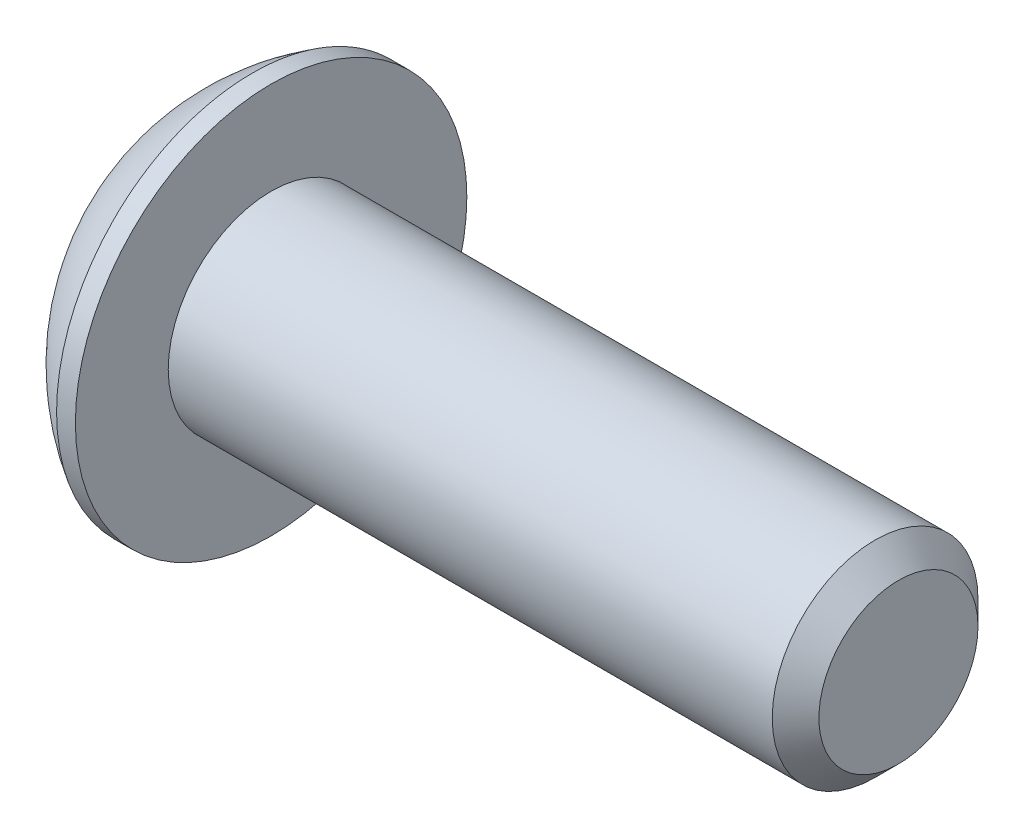
ISO-10303-21;
HEADER;
FILE_DESCRIPTION(('STEP AP214'),'2;1');
FILE_NAME('part.step','',(''),(''),'','','');
FILE_SCHEMA(('AUTOMOTIVE_DESIGN { 1 0 10303 214 1 1 1 1 }'));
ENDSEC;
DATA;
#1=APPLICATION_CONTEXT('core data for automotive mechanical design processes');
#2=APPLICATION_PROTOCOL_DEFINITION('international standard','automotive_design',2000,#1);
#3=PRODUCT_CONTEXT('',#1,'mechanical');
#4=PRODUCT('Part','Part','',(#3));
#5=PRODUCT_RELATED_PRODUCT_CATEGORY('part','',(#4));
#6=PRODUCT_DEFINITION_FORMATION('','',#4);
#7=PRODUCT_DEFINITION_CONTEXT('part definition',#1,'design');
#8=PRODUCT_DEFINITION('design','',#6,#7);
#9=PRODUCT_DEFINITION_SHAPE('','',#8);
#10=(LENGTH_UNIT() NAMED_UNIT(*) SI_UNIT(.MILLI.,.METRE.));
#11=(NAMED_UNIT(*) PLANE_ANGLE_UNIT() SI_UNIT($,.RADIAN.));
#12=(NAMED_UNIT(*) SI_UNIT($,.STERADIAN.) SOLID_ANGLE_UNIT());
#13=UNCERTAINTY_MEASURE_WITH_UNIT(LENGTH_MEASURE(1.E-05),#10,'distance_accuracy_value','');
#14=(GEOMETRIC_REPRESENTATION_CONTEXT(3) GLOBAL_UNCERTAINTY_ASSIGNED_CONTEXT((#13)) GLOBAL_UNIT_ASSIGNED_CONTEXT((#10,
#11,#12)) REPRESENTATION_CONTEXT('',''));
#15=CARTESIAN_POINT('',(0.,0.,0.));
#16=DIRECTION('',(0.,0.,1.));
#17=DIRECTION('',(1.,0.,0.));
#18=AXIS2_PLACEMENT_3D('',#15,#16,#17);
#19=CARTESIAN_POINT('',(1.32080000000034,0.,0.));
#20=DIRECTION('',(-1.,0.,0.));
#21=DIRECTION('',(0.,0.,-1.));
#22=AXIS2_PLACEMENT_3D('',#19,#20,#21);
#23=CONICAL_SURFACE('',#22,1.1937999999998,1.04719755119608);
#24=CARTESIAN_POINT('',(2.01004075135902,0.,-4.44089209850063E-13));
#25=VERTEX_POINT('',#24);
#26=VERTEX_LOOP('',#25);
#27=FACE_BOUND('',#26,.T.);
#28=CARTESIAN_POINT('',(1.32080000000009,0.,0.));
#29=DIRECTION('',(1.,0.,0.));
#30=DIRECTION('',(0.,0.,-1.));
#31=AXIS2_PLACEMENT_3D('',#28,#29,#30);
#32=CIRCLE('',#31,1.19380000000024);
#33=CARTESIAN_POINT('',(1.32080000000004,-1.03386112703797,-0.59690000000006));
#34=VERTEX_POINT('',#33);
#35=CARTESIAN_POINT('',(1.32080000000004,0.,-1.19380000000012));
#36=VERTEX_POINT('',#35);
#37=EDGE_CURVE('E37',#34,#36,#32,.T.);
#38=ORIENTED_EDGE('',*,*,#37,.F.);
#39=CARTESIAN_POINT('',(1.32080000000009,0.,0.));
#40=DIRECTION('',(1.,0.,0.));
#41=DIRECTION('',(0.,0.,-1.));
#42=AXIS2_PLACEMENT_3D('',#39,#40,#41);
#43=CIRCLE('',#42,1.19380000000024);
#44=CARTESIAN_POINT('',(1.32080000000004,-1.03386112703797,0.59690000000006));
#45=VERTEX_POINT('',#44);
#46=EDGE_CURVE('E127',#45,#34,#43,.T.);
#47=ORIENTED_EDGE('',*,*,#46,.F.);
#48=CARTESIAN_POINT('',(1.32080000000009,0.,0.));
#49=DIRECTION('',(1.,0.,0.));
#50=DIRECTION('',(0.,0.,-1.));
#51=AXIS2_PLACEMENT_3D('',#48,#49,#50);
#52=CIRCLE('',#51,1.19380000000024);
#53=CARTESIAN_POINT('',(1.32080000000004,1.49457637585666E-12,1.19380000000012));
#54=VERTEX_POINT('',#53);
#55=EDGE_CURVE('E133',#54,#45,#52,.T.);
#56=ORIENTED_EDGE('',*,*,#55,.F.);
#57=CARTESIAN_POINT('',(1.32080000000009,0.,0.));
#58=DIRECTION('',(1.,0.,0.));
#59=DIRECTION('',(0.,0.,-1.));
#60=AXIS2_PLACEMENT_3D('',#57,#58,#59);
#61=CIRCLE('',#60,1.19380000000024);
#62=CARTESIAN_POINT('',(1.32080000000004,1.03386112703797,0.596900000000061));
#63=VERTEX_POINT('',#62);
#64=EDGE_CURVE('E147',#63,#54,#61,.T.);
#65=ORIENTED_EDGE('',*,*,#64,.F.);
#66=CARTESIAN_POINT('',(1.32080000000009,0.,0.));
#67=DIRECTION('',(1.,0.,0.));
#68=DIRECTION('',(0.,0.,-1.));
#69=AXIS2_PLACEMENT_3D('',#66,#67,#68);
#70=CIRCLE('',#69,1.19380000000024);
#71=CARTESIAN_POINT('',(1.32080000000004,1.03386112703797,-0.596900000000061));
#72=VERTEX_POINT('',#71);
#73=EDGE_CURVE('E140',#72,#63,#70,.T.);
#74=ORIENTED_EDGE('',*,*,#73,.F.);
#75=CARTESIAN_POINT('',(1.32080000000009,0.,0.));
#76=DIRECTION('',(1.,0.,0.));
#77=DIRECTION('',(0.,0.,-1.));
#78=AXIS2_PLACEMENT_3D('',#75,#76,#77);
#79=CIRCLE('',#78,1.19380000000024);
#80=EDGE_CURVE('E137',#36,#72,#79,.T.);
#81=ORIENTED_EDGE('',*,*,#80,.F.);
#82=EDGE_LOOP('',(#38,#47,#56,#65,#74,#81));
#83=FACE_BOUND('',#82,.T.);
#84=ADVANCED_FACE('F34',(#27,#83),#23,.F.);
#85=CARTESIAN_POINT('',(1.3208,-2.06772225407572,1.1938));
#86=DIRECTION('',(1.,0.,0.));
#87=DIRECTION('',(0.,0.,1.));
#88=AXIS2_PLACEMENT_3D('',#85,#86,#87);
#89=PLANE('',#88);
#90=DIRECTION('',(0.,0.5,-0.866025403784439));
#91=VECTOR('',#90,1.);
#92=CARTESIAN_POINT('',(1.3208,-1.37848150271715,0.));
#93=LINE('',#92,#91);
#94=CARTESIAN_POINT('',(1.3208,-0.689240751358574,-1.1938));
#95=VERTEX_POINT('',#94);
#96=EDGE_CURVE('E109',#95,#34,#93,.F.);
#97=ORIENTED_EDGE('',*,*,#96,.T.);
#98=ORIENTED_EDGE('',*,*,#37,.T.);
#99=DIRECTION('',(0.,1.,0.));
#100=VECTOR('',#99,1.);
#101=CARTESIAN_POINT('',(1.3208,-0.689240751358574,-1.1938));
#102=LINE('',#101,#100);
#103=EDGE_CURVE('E124',#36,#95,#102,.F.);
#104=ORIENTED_EDGE('',*,*,#103,.T.);
#105=EDGE_LOOP('',(#97,#98,#104));
#106=FACE_BOUND('',#105,.T.);
#107=ADVANCED_FACE('F121',(#106),#89,.F.);
#108=CARTESIAN_POINT('',(1.3208,-2.06772225407572,1.1938));
#109=DIRECTION('',(1.,0.,0.));
#110=DIRECTION('',(0.,0.,1.));
#111=AXIS2_PLACEMENT_3D('',#108,#109,#110);
#112=PLANE('',#111);
#113=DIRECTION('',(0.,-0.5,-0.866025403784439));
#114=VECTOR('',#113,1.);
#115=CARTESIAN_POINT('',(1.3208,-0.689240751358574,1.1938));
#116=LINE('',#115,#114);
#117=CARTESIAN_POINT('',(1.3208,-1.37848150271715,0.));
#118=VERTEX_POINT('',#117);
#119=EDGE_CURVE('E129',#118,#45,#116,.F.);
#120=ORIENTED_EDGE('',*,*,#119,.T.);
#121=ORIENTED_EDGE('',*,*,#46,.T.);
#122=DIRECTION('',(0.,0.5,-0.866025403784439));
#123=VECTOR('',#122,1.);
#124=CARTESIAN_POINT('',(1.3208,-1.37848150271715,0.));
#125=LINE('',#124,#123);
#126=EDGE_CURVE('E104',#34,#118,#125,.F.);
#127=ORIENTED_EDGE('',*,*,#126,.T.);
#128=EDGE_LOOP('',(#120,#121,#127));
#129=FACE_BOUND('',#128,.T.);
#130=ADVANCED_FACE('F128',(#129),#112,.F.);
#131=CARTESIAN_POINT('',(1.3208,-2.06772225407572,1.1938));
#132=DIRECTION('',(1.,0.,0.));
#133=DIRECTION('',(0.,0.,1.));
#134=AXIS2_PLACEMENT_3D('',#131,#132,#133);
#135=PLANE('',#134);
#136=DIRECTION('',(0.,1.,0.));
#137=VECTOR('',#136,1.);
#138=CARTESIAN_POINT('',(1.3208,0.689240751358577,1.1938));
#139=LINE('',#138,#137);
#140=CARTESIAN_POINT('',(1.3208,-0.689240751358574,1.1938));
#141=VERTEX_POINT('',#140);
#142=EDGE_CURVE('E166',#141,#54,#139,.T.);
#143=ORIENTED_EDGE('',*,*,#142,.T.);
#144=ORIENTED_EDGE('',*,*,#55,.T.);
#145=DIRECTION('',(0.,-0.5,-0.866025403784439));
#146=VECTOR('',#145,1.);
#147=CARTESIAN_POINT('',(1.3208,-0.689240751358574,1.1938));
#148=LINE('',#147,#146);
#149=EDGE_CURVE('E164',#45,#141,#148,.F.);
#150=ORIENTED_EDGE('',*,*,#149,.T.);
#151=EDGE_LOOP('',(#143,#144,#150));
#152=FACE_BOUND('',#151,.T.);
#153=ADVANCED_FACE('F163',(#152),#135,.F.);
#154=CARTESIAN_POINT('',(1.3208,-2.06772225407572,1.1938));
#155=DIRECTION('',(1.,0.,0.));
#156=DIRECTION('',(0.,0.,1.));
#157=AXIS2_PLACEMENT_3D('',#154,#155,#156);
#158=PLANE('',#157);
#159=DIRECTION('',(0.,-0.5,0.866025403784439));
#160=VECTOR('',#159,1.);
#161=CARTESIAN_POINT('',(1.3208,1.37848150271715,0.));
#162=LINE('',#161,#160);
#163=CARTESIAN_POINT('',(1.3208,0.689240751358577,1.1938));
#164=VERTEX_POINT('',#163);
#165=EDGE_CURVE('E173',#164,#63,#162,.F.);
#166=ORIENTED_EDGE('',*,*,#165,.T.);
#167=ORIENTED_EDGE('',*,*,#64,.T.);
#168=DIRECTION('',(0.,1.,0.));
#169=VECTOR('',#168,1.);
#170=CARTESIAN_POINT('',(1.3208,0.689240751358577,1.1938));
#171=LINE('',#170,#169);
#172=EDGE_CURVE('E171',#54,#164,#171,.T.);
#173=ORIENTED_EDGE('',*,*,#172,.T.);
#174=EDGE_LOOP('',(#166,#167,#173));
#175=FACE_BOUND('',#174,.T.);
#176=ADVANCED_FACE('F170',(#175),#158,.F.);
#177=CARTESIAN_POINT('',(1.3208,-2.06772225407572,1.1938));
#178=DIRECTION('',(1.,0.,0.));
#179=DIRECTION('',(0.,0.,1.));
#180=AXIS2_PLACEMENT_3D('',#177,#178,#179);
#181=PLANE('',#180);
#182=DIRECTION('',(0.,0.5,0.866025403784439));
#183=VECTOR('',#182,1.);
#184=CARTESIAN_POINT('',(1.3208,0.689240751358576,-1.1938));
#185=LINE('',#184,#183);
#186=CARTESIAN_POINT('',(1.3208,1.37848150271715,0.));
#187=VERTEX_POINT('',#186);
#188=EDGE_CURVE('E184',#187,#72,#185,.F.);
#189=ORIENTED_EDGE('',*,*,#188,.T.);
#190=ORIENTED_EDGE('',*,*,#73,.T.);
#191=DIRECTION('',(0.,-0.5,0.866025403784439));
#192=VECTOR('',#191,1.);
#193=CARTESIAN_POINT('',(1.3208,1.37848150271715,0.));
#194=LINE('',#193,#192);
#195=EDGE_CURVE('E176',#63,#187,#194,.F.);
#196=ORIENTED_EDGE('',*,*,#195,.T.);
#197=EDGE_LOOP('',(#189,#190,#196));
#198=FACE_BOUND('',#197,.T.);
#199=ADVANCED_FACE('F182',(#198),#181,.F.);
#200=CARTESIAN_POINT('',(1.3208,-2.06772225407572,1.1938));
#201=DIRECTION('',(1.,0.,0.));
#202=DIRECTION('',(0.,0.,1.));
#203=AXIS2_PLACEMENT_3D('',#200,#201,#202);
#204=PLANE('',#203);
#205=DIRECTION('',(0.,1.,0.));
#206=VECTOR('',#205,1.);
#207=CARTESIAN_POINT('',(1.3208,-0.689240751358574,-1.1938));
#208=LINE('',#207,#206);
#209=CARTESIAN_POINT('',(1.3208,0.689240751358576,-1.1938));
#210=VERTEX_POINT('',#209);
#211=EDGE_CURVE('E144',#210,#36,#208,.F.);
#212=ORIENTED_EDGE('',*,*,#211,.T.);
#213=ORIENTED_EDGE('',*,*,#80,.T.);
#214=DIRECTION('',(0.,0.5,0.866025403784439));
#215=VECTOR('',#214,1.);
#216=CARTESIAN_POINT('',(1.3208,0.689240751358576,-1.1938));
#217=LINE('',#216,#215);
#218=EDGE_CURVE('E186',#72,#210,#217,.F.);
#219=ORIENTED_EDGE('',*,*,#218,.T.);
#220=EDGE_LOOP('',(#212,#213,#219));
#221=FACE_BOUND('',#220,.T.);
#222=ADVANCED_FACE('F307',(#221),#204,.F.);
#223=CARTESIAN_POINT('',(1.3208,-0.689240751358574,-1.1938));
#224=DIRECTION('',(0.,0.,1.));
#225=DIRECTION('',(0.,1.,0.));
#226=AXIS2_PLACEMENT_3D('',#223,#224,#225);
#227=PLANE('',#226);
#228=DIRECTION('',(0.,1.,0.));
#229=VECTOR('',#228,1.);
#230=CARTESIAN_POINT('',(0.,0.,-1.1938));
#231=LINE('',#230,#229);
#232=CARTESIAN_POINT('',(0.,0.689240751358577,-1.1938));
#233=VERTEX_POINT('',#232);
#234=CARTESIAN_POINT('',(0.,-0.689240751358574,-1.1938));
#235=VERTEX_POINT('',#234);
#236=EDGE_CURVE('E194',#233,#235,#231,.F.);
#237=ORIENTED_EDGE('',*,*,#236,.T.);
#238=DIRECTION('',(1.,0.,0.));
#239=VECTOR('',#238,1.);
#240=CARTESIAN_POINT('',(1.3208,-0.689240751358574,-1.1938));
#241=LINE('',#240,#239);
#242=EDGE_CURVE('E116',#235,#95,#241,.T.);
#243=ORIENTED_EDGE('',*,*,#242,.T.);
#244=ORIENTED_EDGE('',*,*,#103,.F.);
#245=ORIENTED_EDGE('',*,*,#211,.F.);
#246=DIRECTION('',(1.,0.,0.));
#247=VECTOR('',#246,1.);
#248=CARTESIAN_POINT('',(1.3208,0.689240751358576,-1.1938));
#249=LINE('',#248,#247);
#250=EDGE_CURVE('E189',#210,#233,#249,.F.);
#251=ORIENTED_EDGE('',*,*,#250,.T.);
#252=EDGE_LOOP('',(#237,#243,#244,#245,#251));
#253=FACE_BOUND('',#252,.T.);
#254=ADVANCED_FACE('F273',(#253),#227,.T.);
#255=CARTESIAN_POINT('',(1.3208,-1.37848150271715,0.));
#256=DIRECTION('',(0.,0.866025403784439,0.5));
#257=DIRECTION('',(0.,0.5,-0.866025403784439));
#258=AXIS2_PLACEMENT_3D('',#255,#256,#257);
#259=PLANE('',#258);
#260=DIRECTION('',(0.,-0.5,0.866025403784439));
#261=VECTOR('',#260,1.);
#262=CARTESIAN_POINT('',(0.,-0.689240751358574,-1.1938));
#263=LINE('',#262,#261);
#264=CARTESIAN_POINT('',(0.,-1.37848150271715,0.));
#265=VERTEX_POINT('',#264);
#266=EDGE_CURVE('E270',#235,#265,#263,.T.);
#267=ORIENTED_EDGE('',*,*,#266,.T.);
#268=DIRECTION('',(1.,0.,0.));
#269=VECTOR('',#268,1.);
#270=CARTESIAN_POINT('',(1.3208,-1.37848150271715,0.));
#271=LINE('',#270,#269);
#272=EDGE_CURVE('E111',#265,#118,#271,.T.);
#273=ORIENTED_EDGE('',*,*,#272,.T.);
#274=ORIENTED_EDGE('',*,*,#126,.F.);
#275=ORIENTED_EDGE('',*,*,#96,.F.);
#276=ORIENTED_EDGE('',*,*,#242,.F.);
#277=EDGE_LOOP('',(#267,#273,#274,#275,#276));
#278=FACE_BOUND('',#277,.T.);
#279=ADVANCED_FACE('F107',(#278),#259,.T.);
#280=CARTESIAN_POINT('',(1.3208,-0.689240751358574,1.1938));
#281=DIRECTION('',(0.,0.866025403784439,-0.5));
#282=DIRECTION('',(0.,-0.5,-0.866025403784439));
#283=AXIS2_PLACEMENT_3D('',#280,#281,#282);
#284=PLANE('',#283);
#285=DIRECTION('',(0.,0.5,0.866025403784439));
#286=VECTOR('',#285,1.);
#287=CARTESIAN_POINT('',(0.,-1.37848150271715,0.));
#288=LINE('',#287,#286);
#289=CARTESIAN_POINT('',(0.,-0.689240751358574,1.1938));
#290=VERTEX_POINT('',#289);
#291=EDGE_CURVE('E268',#265,#290,#288,.T.);
#292=ORIENTED_EDGE('',*,*,#291,.T.);
#293=DIRECTION('',(1.,0.,0.));
#294=VECTOR('',#293,1.);
#295=CARTESIAN_POINT('',(1.3208,-0.689240751358574,1.1938));
#296=LINE('',#295,#294);
#297=EDGE_CURVE('E177',#290,#141,#296,.T.);
#298=ORIENTED_EDGE('',*,*,#297,.T.);
#299=ORIENTED_EDGE('',*,*,#149,.F.);
#300=ORIENTED_EDGE('',*,*,#119,.F.);
#301=ORIENTED_EDGE('',*,*,#272,.F.);
#302=EDGE_LOOP('',(#292,#298,#299,#300,#301));
#303=FACE_BOUND('',#302,.T.);
#304=ADVANCED_FACE('F278',(#303),#284,.T.);
#305=CARTESIAN_POINT('',(1.3208,0.689240751358577,1.1938));
#306=DIRECTION('',(0.,0.,-1.));
#307=DIRECTION('',(1.,0.,0.));
#308=AXIS2_PLACEMENT_3D('',#305,#306,#307);
#309=PLANE('',#308);
#310=DIRECTION('',(0.,1.,0.));
#311=VECTOR('',#310,1.);
#312=CARTESIAN_POINT('',(0.,0.,1.1938));
#313=LINE('',#312,#311);
#314=CARTESIAN_POINT('',(0.,0.689240751358577,1.1938));
#315=VERTEX_POINT('',#314);
#316=EDGE_CURVE('E260',#290,#315,#313,.T.);
#317=ORIENTED_EDGE('',*,*,#316,.T.);
#318=DIRECTION('',(1.,0.,0.));
#319=VECTOR('',#318,1.);
#320=CARTESIAN_POINT('',(1.3208,0.689240751358577,1.1938));
#321=LINE('',#320,#319);
#322=EDGE_CURVE('E187',#315,#164,#321,.T.);
#323=ORIENTED_EDGE('',*,*,#322,.T.);
#324=ORIENTED_EDGE('',*,*,#172,.F.);
#325=ORIENTED_EDGE('',*,*,#142,.F.);
#326=ORIENTED_EDGE('',*,*,#297,.F.);
#327=EDGE_LOOP('',(#317,#323,#324,#325,#326));
#328=FACE_BOUND('',#327,.T.);
#329=ADVANCED_FACE('F280',(#328),#309,.T.);
#330=CARTESIAN_POINT('',(1.3208,1.37848150271715,0.));
#331=DIRECTION('',(0.,-0.866025403784439,-0.5));
#332=DIRECTION('',(0.,-0.5,0.866025403784439));
#333=AXIS2_PLACEMENT_3D('',#330,#331,#332);
#334=PLANE('',#333);
#335=DIRECTION('',(0.,0.5,-0.866025403784439));
#336=VECTOR('',#335,1.);
#337=CARTESIAN_POINT('',(0.,0.689240751358577,1.1938));
#338=LINE('',#337,#336);
#339=CARTESIAN_POINT('',(0.,1.37848150271715,0.));
#340=VERTEX_POINT('',#339);
#341=EDGE_CURVE('E257',#315,#340,#338,.T.);
#342=ORIENTED_EDGE('',*,*,#341,.T.);
#343=DIRECTION('',(1.,0.,0.));
#344=VECTOR('',#343,1.);
#345=CARTESIAN_POINT('',(1.3208,1.37848150271715,0.));
#346=LINE('',#345,#344);
#347=EDGE_CURVE('E202',#340,#187,#346,.T.);
#348=ORIENTED_EDGE('',*,*,#347,.T.);
#349=ORIENTED_EDGE('',*,*,#195,.F.);
#350=ORIENTED_EDGE('',*,*,#165,.F.);
#351=ORIENTED_EDGE('',*,*,#322,.F.);
#352=EDGE_LOOP('',(#342,#348,#349,#350,#351));
#353=FACE_BOUND('',#352,.T.);
#354=ADVANCED_FACE('F281',(#353),#334,.T.);
#355=CARTESIAN_POINT('',(1.3208,0.689240751358576,-1.1938));
#356=DIRECTION('',(0.,-0.866025403784439,0.5));
#357=DIRECTION('',(0.,0.5,0.866025403784439));
#358=AXIS2_PLACEMENT_3D('',#355,#356,#357);
#359=PLANE('',#358);
#360=DIRECTION('',(0.,-0.5,-0.866025403784439));
#361=VECTOR('',#360,1.);
#362=CARTESIAN_POINT('',(0.,1.37848150271715,0.));
#363=LINE('',#362,#361);
#364=EDGE_CURVE('E52',#340,#233,#363,.T.);
#365=ORIENTED_EDGE('',*,*,#364,.T.);
#366=ORIENTED_EDGE('',*,*,#250,.F.);
#367=ORIENTED_EDGE('',*,*,#218,.F.);
#368=ORIENTED_EDGE('',*,*,#188,.F.);
#369=ORIENTED_EDGE('',*,*,#347,.F.);
#370=EDGE_LOOP('',(#365,#366,#367,#368,#369));
#371=FACE_BOUND('',#370,.T.);
#372=ADVANCED_FACE('F282',(#371),#359,.T.);
#373=CARTESIAN_POINT('',(0.,0.,0.));
#374=DIRECTION('',(-1.,0.,0.));
#375=DIRECTION('',(0.,0.,-1.));
#376=AXIS2_PLACEMENT_3D('',#373,#374,#375);
#377=PLANE('',#376);
#378=ORIENTED_EDGE('',*,*,#341,.F.);
#379=ORIENTED_EDGE('',*,*,#316,.F.);
#380=ORIENTED_EDGE('',*,*,#291,.F.);
#381=ORIENTED_EDGE('',*,*,#266,.F.);
#382=ORIENTED_EDGE('',*,*,#236,.F.);
#383=ORIENTED_EDGE('',*,*,#364,.F.);
#384=EDGE_LOOP('',(#378,#379,#380,#381,#382,#383));
#385=FACE_BOUND('',#384,.T.);
#386=CARTESIAN_POINT('',(0.,1.9812,0.));
#387=CARTESIAN_POINT('',(0.,1.9811996664299,-0.0556258831179428));
#388=CARTESIAN_POINT('',(0.,1.97885520380442,-0.111261989398606));
#389=CARTESIAN_POINT('',(0.,1.96949260169541,-0.222149719830458));
#390=CARTESIAN_POINT('',(0.,1.96247308239605,-0.277401225602895));
#391=CARTESIAN_POINT('',(0.,1.94379192841038,-0.387209508139747));
#392=CARTESIAN_POINT('',(-1.85325793235264E-13,1.93212292489526,-0.441765039546365));
#393=CARTESIAN_POINT('',(1.86344214223505E-13,1.90422331175315,-0.549729449347493));
#394=CARTESIAN_POINT('',(6.94543371897454E-13,1.88798900035338,-0.603137359208869));
#395=CARTESIAN_POINT('',(1.15501975216981E-12,1.83266214476501,-0.760839131321828));
#396=CARTESIAN_POINT('',(0.,1.78690023648845,-0.862876433575429));
#397=CARTESIAN_POINT('',(0.,1.67887358150667,-1.05780719540872));
#398=CARTESIAN_POINT('',(9.54193214892627E-13,1.6166082074585,-1.15070030720801));
#399=CARTESIAN_POINT('',(5.94805591894675E-13,1.51224157140982,-1.28116890915697));
#400=CARTESIAN_POINT('',(1.63221293851378E-13,1.4755970394354,-1.32320451127026));
#401=CARTESIAN_POINT('',(-1.62196980336157E-13,1.39893832619713,-1.40400288695709));
#402=CARTESIAN_POINT('',(0.,1.35892742784698,-1.44276877695455));
#403=CARTESIAN_POINT('',(1.14362537325405E-13,1.23416504602197,-1.55382272417904));
#404=CARTESIAN_POINT('',(0.,1.14466125559859,-1.62089527952111));
#405=CARTESIAN_POINT('',(0.,0.955712144178167,-1.7390221808118));
#406=CARTESIAN_POINT('',(0.,0.856267198233564,-1.79007713076007));
#407=CARTESIAN_POINT('',(0.,0.650206345910843,-1.87477637530954));
#408=CARTESIAN_POINT('',(0.,0.543590516134855,-1.90842085586267));
#409=CARTESIAN_POINT('',(0.,0.326226155292018,-1.95733039300656));
#410=CARTESIAN_POINT('',(0.,0.21547760215793,-1.97259535144288));
#411=CARTESIAN_POINT('',(0.,-0.00701040587544633,-1.98431697865418));
#412=CARTESIAN_POINT('',(0.,-0.118749860774734,-1.98077364742917));
#413=CARTESIAN_POINT('',(0.,-0.340050178355485,-1.95497485623825));
#414=CARTESIAN_POINT('',(0.,-0.449611052668256,-1.93271949620218));
#415=CARTESIAN_POINT('',(0.,-0.663431110729174,-1.87014138774524));
#416=CARTESIAN_POINT('',(0.,-0.76769023783852,-1.82981844635272));
#417=CARTESIAN_POINT('',(0.,-0.968005760719347,-1.73219968377096));
#418=CARTESIAN_POINT('',(0.,-1.0640618469811,-1.6749032225164));
#419=CARTESIAN_POINT('',(0.,-1.19980276751283,-1.57757371205873));
#420=CARTESIAN_POINT('',(0.,-1.24366557129213,-1.54322665019466));
#421=CARTESIAN_POINT('',(0.,-1.32838995706696,-1.47093063174264));
#422=CARTESIAN_POINT('',(0.,-1.36924860178706,-1.43297823102439));
#423=CARTESIAN_POINT('',(0.,-1.48674671849223,-1.31419842051173));
#424=CARTESIAN_POINT('',(0.,-1.55842832343237,-1.22836221289311));
#425=CARTESIAN_POINT('',(0.,-1.6863396856475,-1.04586168272493));
#426=CARTESIAN_POINT('',(0.,-1.7425700302488,-0.949197771949775));
#427=CARTESIAN_POINT('',(0.,-1.8141614250401,-0.798182600298684));
#428=CARTESIAN_POINT('',(0.,-1.83591780585875,-0.74677620384779));
#429=CARTESIAN_POINT('',(0.,-1.87500754181092,-0.642341081688635));
#430=CARTESIAN_POINT('',(0.,-1.89234447645404,-0.589313708122846));
#431=CARTESIAN_POINT('',(0.,-1.92246053433555,-0.482076273028395));
#432=CARTESIAN_POINT('',(0.,-1.93524685475118,-0.42786822425751));
#433=CARTESIAN_POINT('',(0.,-1.95620937250494,-0.318578151844611));
#434=CARTESIAN_POINT('',(0.,-1.96438692958147,-0.263496390912872));
#435=CARTESIAN_POINT('',(0.,-1.97388528284653,-0.173607715038558));
#436=CARTESIAN_POINT('',(0.,-1.97662743364426,-0.138944718024998));
#437=CARTESIAN_POINT('',(0.,-1.98028489645283,-0.0695224782567002));
#438=CARTESIAN_POINT('',(0.,-1.98120020846367,-0.0347632355019631));
#439=CARTESIAN_POINT('',(0.,-1.9811996664299,0.0556258831179437));
#440=CARTESIAN_POINT('',(0.,-1.97885520380442,0.111261989398607));
#441=CARTESIAN_POINT('',(0.,-1.96949260169541,0.222149719830459));
#442=CARTESIAN_POINT('',(0.,-1.96247308239606,0.277401225602897));
#443=CARTESIAN_POINT('',(0.,-1.94379192841039,0.38720950813975));
#444=CARTESIAN_POINT('',(-1.85269749640692E-13,-1.93212292489526,0.441765039546367));
#445=CARTESIAN_POINT('',(1.86288125054388E-13,-1.90422331175315,0.549729449347495));
#446=CARTESIAN_POINT('',(6.94525090263764E-13,-1.88798900035338,0.603137359208872));
#447=CARTESIAN_POINT('',(1.15505622829081E-12,-1.83266214476501,0.760839131321831));
#448=CARTESIAN_POINT('',(0.,-1.78690023648845,0.862876433575431));
#449=CARTESIAN_POINT('',(0.,-1.67887358150667,1.05780719540872));
#450=CARTESIAN_POINT('',(9.5424881286938E-13,-1.6166082074585,1.15070030720801));
#451=CARTESIAN_POINT('',(5.94777756479239E-13,-1.51224157140982,1.28116890915698));
#452=CARTESIAN_POINT('',(1.63138949183833E-13,-1.47559703943539,1.32320451127027));
#453=CARTESIAN_POINT('',(-1.62114715061273E-13,-1.39893832619713,1.40400288695709));
#454=CARTESIAN_POINT('',(0.,-1.35892742784699,1.44276877695455));
#455=CARTESIAN_POINT('',(1.13760489124207E-13,-1.23416504602197,1.55382272417904));
#456=CARTESIAN_POINT('',(0.,-1.14466125559859,1.62089527952111));
#457=CARTESIAN_POINT('',(0.,-0.95571214417816,1.73902218081179));
#458=CARTESIAN_POINT('',(0.,-0.856267198233559,1.79007713076007));
#459=CARTESIAN_POINT('',(0.,-0.65020634591084,1.87477637530954));
#460=CARTESIAN_POINT('',(0.,-0.543590516134854,1.90842085586267));
#461=CARTESIAN_POINT('',(0.,-0.326226155292018,1.95733039300657));
#462=CARTESIAN_POINT('',(0.,-0.215477602157929,1.97259535144288));
#463=CARTESIAN_POINT('',(0.,0.00701040587544865,1.98431697865418));
#464=CARTESIAN_POINT('',(0.,0.118749860774737,1.98077364742916));
#465=CARTESIAN_POINT('',(0.,0.340050178355489,1.95497485623824));
#466=CARTESIAN_POINT('',(0.,0.44961105266826,1.93271949620218));
#467=CARTESIAN_POINT('',(0.,0.663431110729178,1.87014138774524));
#468=CARTESIAN_POINT('',(0.,0.767690237838524,1.82981844635272));
#469=CARTESIAN_POINT('',(0.,0.968005760719347,1.73219968377096));
#470=CARTESIAN_POINT('',(0.,1.0640618469811,1.67490322251639));
#471=CARTESIAN_POINT('',(0.,1.19980276751283,1.57757371205873));
#472=CARTESIAN_POINT('',(0.,1.24366557129214,1.54322665019465));
#473=CARTESIAN_POINT('',(0.,1.32838995706696,1.47093063174263));
#474=CARTESIAN_POINT('',(0.,1.36924860178706,1.43297823102439));
#475=CARTESIAN_POINT('',(0.,1.48674671849223,1.31419842051172));
#476=CARTESIAN_POINT('',(0.,1.55842832343237,1.22836221289311));
#477=CARTESIAN_POINT('',(0.,1.6863396856475,1.04586168272492));
#478=CARTESIAN_POINT('',(0.,1.7425700302488,0.949197771949768));
#479=CARTESIAN_POINT('',(0.,1.8141614250401,0.798182600298677));
#480=CARTESIAN_POINT('',(0.,1.83591780585875,0.746776203847785));
#481=CARTESIAN_POINT('',(0.,1.87500754181092,0.64234108168863));
#482=CARTESIAN_POINT('',(0.,1.89234447645404,0.589313708122841));
#483=CARTESIAN_POINT('',(0.,1.92246053433555,0.482076273028389));
#484=CARTESIAN_POINT('',(0.,1.93524685475118,0.427868224257504));
#485=CARTESIAN_POINT('',(0.,1.95620937250494,0.318578151844605));
#486=CARTESIAN_POINT('',(0.,1.96438692958147,0.263496390912866));
#487=CARTESIAN_POINT('',(0.,1.97388528284653,0.173607715038553));
#488=CARTESIAN_POINT('',(0.,1.97662743364426,0.138944718024994));
#489=CARTESIAN_POINT('',(0.,1.98028489645283,0.0695224782566989));
#490=CARTESIAN_POINT('',(0.,1.98120020846367,0.034763235501963));
#491=CARTESIAN_POINT('',(0.,1.9812,0.));
#492=B_SPLINE_CURVE_WITH_KNOTS('',3,(#386,#387,#388,#389,#390,#391,#392,#393,#394,#395,#396,
#397,#398,#399,#400,#401,#402,#403,#404,#405,#406,#407,#408,#409,#410,#411,#412,#413,#414,#415,
#416,#417,#418,#419,#420,#421,#422,#423,#424,#425,#426,#427,#428,#429,#430,#431,#432,#433,#434,
#435,#436,#437,#438,#439,#440,#441,#442,#443,#444,#445,#446,#447,#448,#449,#450,#451,#452,#453,
#454,#455,#456,#457,#458,#459,#460,#461,#462,#463,#464,#465,#466,#467,#468,#469,#470,#471,#472,
#473,#474,#475,#476,#477,#478,#479,#480,#481,#482,#483,#484,#485,#486,#487,#488,#489,#490,#491),
.UNSPECIFIED.,.T.,.F.,(4,2,2,2,2,2,2,2,2,2,2,2,2,2,2,2,2,2,2,2,2,2,2,2,2,2,2,2,2,2,2,2,2,2,2,2,
2,2,2,2,2,2,2,2,2,2,2,2,2,2,2,2,4),(0.,0.166845646007828,0.333740557374255,0.500901034367693,
0.668197445942386,1.00199278686282,1.33580081809885,1.50292354032982,1.6698851310853,
2.00370118900129,2.33750465770544,2.67130456115909,3.00510624723801,3.33890793331696,
3.67270783677065,4.00651130547476,4.34032736339026,4.50728895414554,4.67441167637632,
5.00821970761259,5.34201504853332,5.50931146010827,5.67647193710191,5.84336684846844,
6.0102124944764,6.11448220058334,6.21875190669029,6.38559755269812,6.55249246406454,
6.71965294105798,6.88694935263268,7.22074469355311,7.55455272478915,7.72167544702011,
7.88863703777559,8.22245309569158,8.55625656439573,8.89005646784938,9.2238581539283,
9.55765984000725,9.89145974346094,10.2252632121651,10.5590792700806,10.7260408608358,
10.8931635830666,11.2269716143029,11.5607669552236,11.7280633667986,11.8952238437922,
12.0621187551587,12.2289644011667,12.3332341072736,12.4375038133806),.UNSPECIFIED.);
#493=CARTESIAN_POINT('',(0.,1.9812,0.));
#494=VERTEX_POINT('',#493);
#495=EDGE_CURVE('E150',#494,#494,#492,.T.);
#496=ORIENTED_EDGE('',*,*,#495,.T.);
#497=EDGE_LOOP('',(#496));
#498=FACE_BOUND('',#497,.T.);
#499=ADVANCED_FACE('F275',(#385,#498),#377,.T.);
#500=CARTESIAN_POINT('',(4.13385,0.,0.));
#501=DIRECTION('',(0.,1.,0.));
#502=DIRECTION('',(1.,0.,0.));
#503=AXIS2_PLACEMENT_3D('',#500,#501,#502);
#504=SPHERICAL_SURFACE('',#503,4.58408870578439);
#505=CARTESIAN_POINT('',(1.8288,0.,0.));
#506=DIRECTION('',(1.,0.,0.));
#507=DIRECTION('',(0.,0.,-1.));
#508=AXIS2_PLACEMENT_3D('',#505,#506,#507);
#509=CIRCLE('',#508,3.9624);
#510=CARTESIAN_POINT('',(1.8288,0.,-3.9624));
#511=VERTEX_POINT('',#510);
#512=EDGE_CURVE('E250',#511,#511,#509,.F.);
#513=ORIENTED_EDGE('',*,*,#512,.T.);
#514=EDGE_LOOP('',(#513));
#515=FACE_BOUND('',#514,.T.);
#516=ORIENTED_EDGE('',*,*,#495,.F.);
#517=EDGE_LOOP('',(#516));
#518=FACE_BOUND('',#517,.T.);
#519=ADVANCED_FACE('F289',(#515,#518),#504,.T.);
#520=CARTESIAN_POINT('',(14.9098,0.,0.));
#521=DIRECTION('',(-1.,0.,0.));
#522=DIRECTION('',(0.,0.,-1.));
#523=AXIS2_PLACEMENT_3D('',#520,#521,#522);
#524=PLANE('',#523);
#525=CARTESIAN_POINT('',(14.9098000000549,0.,0.));
#526=DIRECTION('',(1.,0.,0.));
#527=DIRECTION('',(0.,0.,-1.));
#528=AXIS2_PLACEMENT_3D('',#525,#526,#527);
#529=CIRCLE('',#528,1.61035999997239);
#530=CARTESIAN_POINT('',(14.9098000000549,0.,-1.61035999997239));
#531=VERTEX_POINT('',#530);
#532=EDGE_CURVE('E248',#531,#531,#529,.T.);
#533=ORIENTED_EDGE('',*,*,#532,.T.);
#534=EDGE_LOOP('',(#533));
#535=FACE_BOUND('',#534,.T.);
#536=ADVANCED_FACE('F346',(#535),#524,.F.);
#537=CARTESIAN_POINT('',(0.,0.,0.));
#538=DIRECTION('',(-1.,0.,0.));
#539=DIRECTION('',(0.,0.,-1.));
#540=AXIS2_PLACEMENT_3D('',#537,#538,#539);
#541=CYLINDRICAL_SURFACE('',#540,3.9624);
#542=ORIENTED_EDGE('',*,*,#512,.F.);
#543=EDGE_LOOP('',(#542));
#544=FACE_BOUND('',#543,.T.);
#545=CARTESIAN_POINT('',(2.2098,0.,0.));
#546=DIRECTION('',(1.,0.,0.));
#547=DIRECTION('',(0.,0.,-1.));
#548=AXIS2_PLACEMENT_3D('',#545,#546,#547);
#549=CIRCLE('',#548,3.9624);
#550=CARTESIAN_POINT('',(2.2098,0.,-3.9624));
#551=VERTEX_POINT('',#550);
#552=EDGE_CURVE('E245',#551,#551,#549,.T.);
#553=ORIENTED_EDGE('',*,*,#552,.F.);
#554=EDGE_LOOP('',(#553));
#555=FACE_BOUND('',#554,.T.);
#556=ADVANCED_FACE('F354',(#544,#555),#541,.T.);
#557=CARTESIAN_POINT('',(14.4373599999881,0.,0.));
#558=DIRECTION('',(-1.,0.,0.));
#559=DIRECTION('',(0.,0.,-1.));
#560=AXIS2_PLACEMENT_3D('',#557,#558,#559);
#561=CONICAL_SURFACE('',#560,2.08280000003924,0.785398163397448);
#562=CARTESIAN_POINT('',(14.43736,0.,0.));
#563=DIRECTION('',(1.,0.,0.));
#564=DIRECTION('',(0.,0.,-1.));
#565=AXIS2_PLACEMENT_3D('',#562,#563,#564);
#566=CIRCLE('',#565,2.0828);
#567=CARTESIAN_POINT('',(14.43736,0.,-2.0828));
#568=VERTEX_POINT('',#567);
#569=EDGE_CURVE('E43',#568,#568,#566,.T.);
#570=ORIENTED_EDGE('',*,*,#569,.T.);
#571=EDGE_LOOP('',(#570));
#572=FACE_BOUND('',#571,.T.);
#573=ORIENTED_EDGE('',*,*,#532,.F.);
#574=EDGE_LOOP('',(#573));
#575=FACE_BOUND('',#574,.T.);
#576=ADVANCED_FACE('F364',(#572,#575),#561,.T.);
#577=CARTESIAN_POINT('',(2.2098,2.0828,0.));
#578=DIRECTION('',(-1.,0.,0.));
#579=DIRECTION('',(0.,0.,-1.));
#580=AXIS2_PLACEMENT_3D('',#577,#578,#579);
#581=PLANE('',#580);
#582=CARTESIAN_POINT('',(2.2098,0.,0.));
#583=DIRECTION('',(1.,0.,0.));
#584=DIRECTION('',(0.,0.,-1.));
#585=AXIS2_PLACEMENT_3D('',#582,#583,#584);
#586=CIRCLE('',#585,2.0828);
#587=CARTESIAN_POINT('',(2.2098,0.,-2.0828));
#588=VERTEX_POINT('',#587);
#589=EDGE_CURVE('E11',#588,#588,#586,.F.);
#590=ORIENTED_EDGE('',*,*,#589,.T.);
#591=EDGE_LOOP('',(#590));
#592=FACE_BOUND('',#591,.T.);
#593=ORIENTED_EDGE('',*,*,#552,.T.);
#594=EDGE_LOOP('',(#593));
#595=FACE_BOUND('',#594,.T.);
#596=ADVANCED_FACE('F374',(#592,#595),#581,.F.);
#597=CARTESIAN_POINT('',(0.,0.,0.));
#598=DIRECTION('',(-1.,0.,0.));
#599=DIRECTION('',(0.,0.,-1.));
#600=AXIS2_PLACEMENT_3D('',#597,#598,#599);
#601=CYLINDRICAL_SURFACE('',#600,2.0828);
#602=ORIENTED_EDGE('',*,*,#589,.F.);
#603=EDGE_LOOP('',(#602));
#604=FACE_BOUND('',#603,.T.);
#605=ORIENTED_EDGE('',*,*,#569,.F.);
#606=EDGE_LOOP('',(#605));
#607=FACE_BOUND('',#606,.T.);
#608=ADVANCED_FACE('F384',(#604,#607),#601,.T.);
#609=CLOSED_SHELL('',(#84,#107,#130,#153,#176,#199,#222,#254,#279,#304,#329,#354,#372,#499,#519,
#536,#556,#576,#596,#608));
#610=MANIFOLD_SOLID_BREP('B2',#609);
#611=ADVANCED_BREP_SHAPE_REPRESENTATION('',(#18,#610),#14);
#612=SHAPE_DEFINITION_REPRESENTATION(#9,#611);
ENDSEC;
END-ISO-10303-21;
